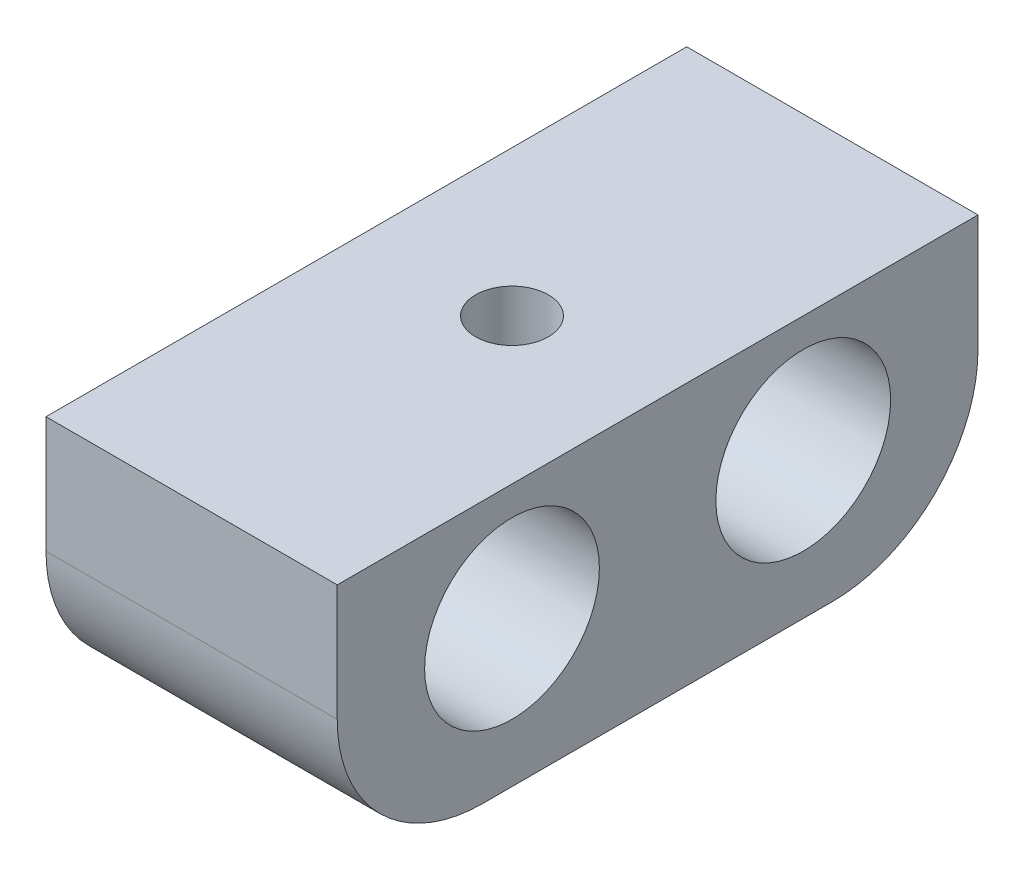
ISO-10303-21;
HEADER;
FILE_DESCRIPTION(('STEP AP214'),'2;1');
FILE_NAME('part.step','',(''),(''),'','','');
FILE_SCHEMA(('AUTOMOTIVE_DESIGN { 1 0 10303 214 1 1 1 1 }'));
ENDSEC;
DATA;
#1=APPLICATION_CONTEXT('core data for automotive mechanical design processes');
#2=APPLICATION_PROTOCOL_DEFINITION('international standard','automotive_design',2000,#1);
#3=PRODUCT_CONTEXT('',#1,'mechanical');
#4=PRODUCT('Part','Part','',(#3));
#5=PRODUCT_RELATED_PRODUCT_CATEGORY('part','',(#4));
#6=PRODUCT_DEFINITION_FORMATION('','',#4);
#7=PRODUCT_DEFINITION_CONTEXT('part definition',#1,'design');
#8=PRODUCT_DEFINITION('design','',#6,#7);
#9=PRODUCT_DEFINITION_SHAPE('','',#8);
#10=(LENGTH_UNIT() NAMED_UNIT(*) SI_UNIT(.MILLI.,.METRE.));
#11=(NAMED_UNIT(*) PLANE_ANGLE_UNIT() SI_UNIT($,.RADIAN.));
#12=(NAMED_UNIT(*) SI_UNIT($,.STERADIAN.) SOLID_ANGLE_UNIT());
#13=UNCERTAINTY_MEASURE_WITH_UNIT(LENGTH_MEASURE(1.E-05),#10,'distance_accuracy_value','');
#14=(GEOMETRIC_REPRESENTATION_CONTEXT(3) GLOBAL_UNCERTAINTY_ASSIGNED_CONTEXT((#13)) GLOBAL_UNIT_ASSIGNED_CONTEXT((#10,
#11,#12)) REPRESENTATION_CONTEXT('',''));
#15=CARTESIAN_POINT('',(0.,0.,0.));
#16=DIRECTION('',(0.,0.,1.));
#17=DIRECTION('',(1.,0.,0.));
#18=AXIS2_PLACEMENT_3D('',#15,#16,#17);
#19=CARTESIAN_POINT('',(10.,0.,0.));
#20=DIRECTION('',(1.,0.,0.));
#21=DIRECTION('',(0.,0.,-1.));
#22=AXIS2_PLACEMENT_3D('',#19,#20,#21);
#23=PLANE('',#22);
#24=CARTESIAN_POINT('',(10.,0.,0.));
#25=DIRECTION('',(1.,0.,0.));
#26=DIRECTION('',(0.,0.,-1.));
#27=AXIS2_PLACEMENT_3D('',#24,#25,#26);
#28=CIRCLE('',#27,3.);
#29=CARTESIAN_POINT('',(10.,0.,-3.));
#30=VERTEX_POINT('',#29);
#31=EDGE_CURVE('E115',#30,#30,#28,.T.);
#32=ORIENTED_EDGE('',*,*,#31,.F.);
#33=EDGE_LOOP('',(#32));
#34=FACE_BOUND('',#33,.T.);
#35=DIRECTION('',(0.,0.,-1.));
#36=VECTOR('',#35,1.);
#37=CARTESIAN_POINT('',(10.,-5.,6.));
#38=LINE('',#37,#36);
#39=CARTESIAN_POINT('',(10.,-5.,1.));
#40=VERTEX_POINT('',#39);
#41=CARTESIAN_POINT('',(10.,-5.,-11.));
#42=VERTEX_POINT('',#41);
#43=EDGE_CURVE('E127',#40,#42,#38,.T.);
#44=ORIENTED_EDGE('',*,*,#43,.T.);
#45=CARTESIAN_POINT('',(10.,0.,-11.));
#46=DIRECTION('',(1.,0.,0.));
#47=DIRECTION('',(0.,0.,-1.));
#48=AXIS2_PLACEMENT_3D('',#45,#46,#47);
#49=CIRCLE('',#48,5.);
#50=CARTESIAN_POINT('',(10.,0.,-16.));
#51=VERTEX_POINT('',#50);
#52=EDGE_CURVE('E47',#42,#51,#49,.T.);
#53=ORIENTED_EDGE('',*,*,#52,.T.);
#54=DIRECTION('',(0.,1.,0.));
#55=VECTOR('',#54,1.);
#56=CARTESIAN_POINT('',(10.,-5.,-16.));
#57=LINE('',#56,#55);
#58=CARTESIAN_POINT('',(10.,4.,-16.));
#59=VERTEX_POINT('',#58);
#60=EDGE_CURVE('E129',#51,#59,#57,.T.);
#61=ORIENTED_EDGE('',*,*,#60,.T.);
#62=DIRECTION('',(0.,0.,1.));
#63=VECTOR('',#62,1.);
#64=CARTESIAN_POINT('',(10.,4.,-16.));
#65=LINE('',#64,#63);
#66=CARTESIAN_POINT('',(10.,4.,6.));
#67=VERTEX_POINT('',#66);
#68=EDGE_CURVE('E121',#59,#67,#65,.T.);
#69=ORIENTED_EDGE('',*,*,#68,.T.);
#70=DIRECTION('',(0.,-1.,0.));
#71=VECTOR('',#70,1.);
#72=CARTESIAN_POINT('',(10.,4.,6.));
#73=LINE('',#72,#71);
#74=CARTESIAN_POINT('',(10.,0.,6.));
#75=VERTEX_POINT('',#74);
#76=EDGE_CURVE('E124',#67,#75,#73,.T.);
#77=ORIENTED_EDGE('',*,*,#76,.T.);
#78=CARTESIAN_POINT('',(10.,0.,1.));
#79=DIRECTION('',(1.,0.,0.));
#80=DIRECTION('',(0.,0.,-1.));
#81=AXIS2_PLACEMENT_3D('',#78,#79,#80);
#82=CIRCLE('',#81,5.);
#83=EDGE_CURVE('E155',#75,#40,#82,.T.);
#84=ORIENTED_EDGE('',*,*,#83,.T.);
#85=EDGE_LOOP('',(#44,#53,#61,#69,#77,#84));
#86=FACE_BOUND('',#85,.T.);
#87=CARTESIAN_POINT('',(10.,0.,-10.));
#88=DIRECTION('',(1.,0.,0.));
#89=DIRECTION('',(0.,0.,-1.));
#90=AXIS2_PLACEMENT_3D('',#87,#88,#89);
#91=CIRCLE('',#90,3.);
#92=CARTESIAN_POINT('',(10.,0.,-13.));
#93=VERTEX_POINT('',#92);
#94=EDGE_CURVE('E107',#93,#93,#91,.T.);
#95=ORIENTED_EDGE('',*,*,#94,.F.);
#96=EDGE_LOOP('',(#95));
#97=FACE_BOUND('',#96,.T.);
#98=ADVANCED_FACE('F39',(#34,#86,#97),#23,.T.);
#99=CARTESIAN_POINT('',(0.,0.,0.));
#100=DIRECTION('',(1.,0.,0.));
#101=DIRECTION('',(0.,0.,-1.));
#102=AXIS2_PLACEMENT_3D('',#99,#100,#101);
#103=PLANE('',#102);
#104=CARTESIAN_POINT('',(0.,0.,0.));
#105=DIRECTION('',(1.,0.,0.));
#106=DIRECTION('',(0.,0.,-1.));
#107=AXIS2_PLACEMENT_3D('',#104,#105,#106);
#108=CIRCLE('',#107,3.);
#109=CARTESIAN_POINT('',(0.,0.,-3.));
#110=VERTEX_POINT('',#109);
#111=EDGE_CURVE('E113',#110,#110,#108,.T.);
#112=ORIENTED_EDGE('',*,*,#111,.T.);
#113=EDGE_LOOP('',(#112));
#114=FACE_BOUND('',#113,.T.);
#115=DIRECTION('',(0.,1.,0.));
#116=VECTOR('',#115,1.);
#117=CARTESIAN_POINT('',(0.,-5.,-16.));
#118=LINE('',#117,#116);
#119=CARTESIAN_POINT('',(0.,0.,-16.));
#120=VERTEX_POINT('',#119);
#121=CARTESIAN_POINT('',(0.,4.,-16.));
#122=VERTEX_POINT('',#121);
#123=EDGE_CURVE('E125',#120,#122,#118,.T.);
#124=ORIENTED_EDGE('',*,*,#123,.F.);
#125=CARTESIAN_POINT('',(0.,0.,-11.));
#126=DIRECTION('',(1.,0.,0.));
#127=DIRECTION('',(0.,0.,-1.));
#128=AXIS2_PLACEMENT_3D('',#125,#126,#127);
#129=CIRCLE('',#128,5.);
#130=CARTESIAN_POINT('',(0.,-5.,-11.));
#131=VERTEX_POINT('',#130);
#132=EDGE_CURVE('E149',#120,#131,#129,.F.);
#133=ORIENTED_EDGE('',*,*,#132,.T.);
#134=DIRECTION('',(0.,0.,-1.));
#135=VECTOR('',#134,1.);
#136=CARTESIAN_POINT('',(0.,-5.,6.));
#137=LINE('',#136,#135);
#138=CARTESIAN_POINT('',(0.,-5.,1.));
#139=VERTEX_POINT('',#138);
#140=EDGE_CURVE('E136',#139,#131,#137,.T.);
#141=ORIENTED_EDGE('',*,*,#140,.F.);
#142=CARTESIAN_POINT('',(0.,0.,1.));
#143=DIRECTION('',(1.,0.,0.));
#144=DIRECTION('',(0.,0.,-1.));
#145=AXIS2_PLACEMENT_3D('',#142,#143,#144);
#146=CIRCLE('',#145,5.);
#147=CARTESIAN_POINT('',(0.,0.,6.));
#148=VERTEX_POINT('',#147);
#149=EDGE_CURVE('E147',#139,#148,#146,.F.);
#150=ORIENTED_EDGE('',*,*,#149,.T.);
#151=DIRECTION('',(0.,-1.,0.));
#152=VECTOR('',#151,1.);
#153=CARTESIAN_POINT('',(0.,4.,6.));
#154=LINE('',#153,#152);
#155=CARTESIAN_POINT('',(0.,4.,6.));
#156=VERTEX_POINT('',#155);
#157=EDGE_CURVE('E134',#156,#148,#154,.T.);
#158=ORIENTED_EDGE('',*,*,#157,.F.);
#159=DIRECTION('',(0.,0.,1.));
#160=VECTOR('',#159,1.);
#161=CARTESIAN_POINT('',(0.,4.,-16.));
#162=LINE('',#161,#160);
#163=EDGE_CURVE('E118',#122,#156,#162,.T.);
#164=ORIENTED_EDGE('',*,*,#163,.F.);
#165=EDGE_LOOP('',(#124,#133,#141,#150,#158,#164));
#166=FACE_BOUND('',#165,.T.);
#167=CARTESIAN_POINT('',(0.,0.,-10.));
#168=DIRECTION('',(1.,0.,0.));
#169=DIRECTION('',(0.,0.,-1.));
#170=AXIS2_PLACEMENT_3D('',#167,#168,#169);
#171=CIRCLE('',#170,3.);
#172=CARTESIAN_POINT('',(0.,0.,-13.));
#173=VERTEX_POINT('',#172);
#174=EDGE_CURVE('E103',#173,#173,#171,.T.);
#175=ORIENTED_EDGE('',*,*,#174,.T.);
#176=EDGE_LOOP('',(#175));
#177=FACE_BOUND('',#176,.T.);
#178=ADVANCED_FACE('F170',(#114,#166,#177),#103,.F.);
#179=CARTESIAN_POINT('',(10.,4.,-16.));
#180=DIRECTION('',(0.,-1.,0.));
#181=DIRECTION('',(0.,0.,-1.));
#182=AXIS2_PLACEMENT_3D('',#179,#180,#181);
#183=PLANE('',#182);
#184=CARTESIAN_POINT('',(5.,4.,-5.));
#185=DIRECTION('',(0.,1.,0.));
#186=DIRECTION('',(0.,0.,1.));
#187=AXIS2_PLACEMENT_3D('',#184,#185,#186);
#188=CIRCLE('',#187,1.24999999999999);
#189=CARTESIAN_POINT('',(5.,4.,-3.75000000000001));
#190=VERTEX_POINT('',#189);
#191=EDGE_CURVE('E104',#190,#190,#188,.T.);
#192=ORIENTED_EDGE('',*,*,#191,.F.);
#193=EDGE_LOOP('',(#192));
#194=FACE_BOUND('',#193,.T.);
#195=ORIENTED_EDGE('',*,*,#163,.T.);
#196=DIRECTION('',(-1.,0.,0.));
#197=VECTOR('',#196,1.);
#198=CARTESIAN_POINT('',(10.,4.,6.));
#199=LINE('',#198,#197);
#200=EDGE_CURVE('E141',#67,#156,#199,.T.);
#201=ORIENTED_EDGE('',*,*,#200,.F.);
#202=ORIENTED_EDGE('',*,*,#68,.F.);
#203=DIRECTION('',(-1.,0.,0.));
#204=VECTOR('',#203,1.);
#205=CARTESIAN_POINT('',(10.,4.,-16.));
#206=LINE('',#205,#204);
#207=EDGE_CURVE('E131',#59,#122,#206,.T.);
#208=ORIENTED_EDGE('',*,*,#207,.T.);
#209=EDGE_LOOP('',(#195,#201,#202,#208));
#210=FACE_BOUND('',#209,.T.);
#211=ADVANCED_FACE('F180',(#194,#210),#183,.F.);
#212=CARTESIAN_POINT('',(10.,4.,6.));
#213=DIRECTION('',(0.,0.,-1.));
#214=DIRECTION('',(0.,1.,0.));
#215=AXIS2_PLACEMENT_3D('',#212,#213,#214);
#216=PLANE('',#215);
#217=ORIENTED_EDGE('',*,*,#157,.T.);
#218=DIRECTION('',(-1.,0.,0.));
#219=VECTOR('',#218,1.);
#220=CARTESIAN_POINT('',(10.,0.,6.));
#221=LINE('',#220,#219);
#222=EDGE_CURVE('E11',#148,#75,#221,.F.);
#223=ORIENTED_EDGE('',*,*,#222,.T.);
#224=ORIENTED_EDGE('',*,*,#76,.F.);
#225=ORIENTED_EDGE('',*,*,#200,.T.);
#226=EDGE_LOOP('',(#217,#223,#224,#225));
#227=FACE_BOUND('',#226,.T.);
#228=ADVANCED_FACE('F177',(#227),#216,.F.);
#229=CARTESIAN_POINT('',(10.,-5.,6.));
#230=DIRECTION('',(0.,1.,0.));
#231=DIRECTION('',(0.,0.,1.));
#232=AXIS2_PLACEMENT_3D('',#229,#230,#231);
#233=PLANE('',#232);
#234=ORIENTED_EDGE('',*,*,#140,.T.);
#235=DIRECTION('',(-1.,0.,0.));
#236=VECTOR('',#235,1.);
#237=CARTESIAN_POINT('',(10.,-5.,-11.));
#238=LINE('',#237,#236);
#239=EDGE_CURVE('E60',#131,#42,#238,.F.);
#240=ORIENTED_EDGE('',*,*,#239,.T.);
#241=ORIENTED_EDGE('',*,*,#43,.F.);
#242=DIRECTION('',(-1.,0.,0.));
#243=VECTOR('',#242,1.);
#244=CARTESIAN_POINT('',(10.,-5.,1.));
#245=LINE('',#244,#243);
#246=EDGE_CURVE('E151',#40,#139,#245,.T.);
#247=ORIENTED_EDGE('',*,*,#246,.T.);
#248=EDGE_LOOP('',(#234,#240,#241,#247));
#249=FACE_BOUND('',#248,.T.);
#250=ADVANCED_FACE('F173',(#249),#233,.F.);
#251=CARTESIAN_POINT('',(10.,-5.,-16.));
#252=DIRECTION('',(0.,0.,1.));
#253=DIRECTION('',(1.,0.,0.));
#254=AXIS2_PLACEMENT_3D('',#251,#252,#253);
#255=PLANE('',#254);
#256=ORIENTED_EDGE('',*,*,#60,.F.);
#257=DIRECTION('',(-1.,0.,0.));
#258=VECTOR('',#257,1.);
#259=CARTESIAN_POINT('',(10.,0.,-16.));
#260=LINE('',#259,#258);
#261=EDGE_CURVE('E144',#51,#120,#260,.T.);
#262=ORIENTED_EDGE('',*,*,#261,.T.);
#263=ORIENTED_EDGE('',*,*,#123,.T.);
#264=ORIENTED_EDGE('',*,*,#207,.F.);
#265=EDGE_LOOP('',(#256,#262,#263,#264));
#266=FACE_BOUND('',#265,.T.);
#267=ADVANCED_FACE('F164',(#266),#255,.F.);
#268=CARTESIAN_POINT('',(10.,0.,0.));
#269=DIRECTION('',(-1.,0.,0.));
#270=DIRECTION('',(0.,0.,1.));
#271=AXIS2_PLACEMENT_3D('',#268,#269,#270);
#272=CYLINDRICAL_SURFACE('',#271,3.);
#273=ORIENTED_EDGE('',*,*,#31,.T.);
#274=EDGE_LOOP('',(#273));
#275=FACE_BOUND('',#274,.T.);
#276=ORIENTED_EDGE('',*,*,#111,.F.);
#277=EDGE_LOOP('',(#276));
#278=FACE_BOUND('',#277,.T.);
#279=ADVANCED_FACE('F199',(#275,#278),#272,.F.);
#280=CARTESIAN_POINT('',(10.,0.,-10.));
#281=DIRECTION('',(-1.,0.,0.));
#282=DIRECTION('',(0.,0.,1.));
#283=AXIS2_PLACEMENT_3D('',#280,#281,#282);
#284=CYLINDRICAL_SURFACE('',#283,3.);
#285=ORIENTED_EDGE('',*,*,#94,.T.);
#286=EDGE_LOOP('',(#285));
#287=FACE_BOUND('',#286,.T.);
#288=ORIENTED_EDGE('',*,*,#174,.F.);
#289=EDGE_LOOP('',(#288));
#290=FACE_BOUND('',#289,.T.);
#291=ADVANCED_FACE('F220',(#287,#290),#284,.F.);
#292=CARTESIAN_POINT('',(10.,0.,-11.));
#293=DIRECTION('',(-1.,0.,0.));
#294=DIRECTION('',(0.,0.,1.));
#295=AXIS2_PLACEMENT_3D('',#292,#293,#294);
#296=CYLINDRICAL_SURFACE('',#295,5.);
#297=ORIENTED_EDGE('',*,*,#52,.F.);
#298=ORIENTED_EDGE('',*,*,#239,.F.);
#299=ORIENTED_EDGE('',*,*,#132,.F.);
#300=ORIENTED_EDGE('',*,*,#261,.F.);
#301=EDGE_LOOP('',(#297,#298,#299,#300));
#302=FACE_BOUND('',#301,.T.);
#303=ADVANCED_FACE('F167',(#302),#296,.T.);
#304=CARTESIAN_POINT('',(10.,0.,1.));
#305=DIRECTION('',(-1.,0.,0.));
#306=DIRECTION('',(0.,0.,1.));
#307=AXIS2_PLACEMENT_3D('',#304,#305,#306);
#308=CYLINDRICAL_SURFACE('',#307,5.);
#309=ORIENTED_EDGE('',*,*,#83,.F.);
#310=ORIENTED_EDGE('',*,*,#222,.F.);
#311=ORIENTED_EDGE('',*,*,#149,.F.);
#312=ORIENTED_EDGE('',*,*,#246,.F.);
#313=EDGE_LOOP('',(#309,#310,#311,#312));
#314=FACE_BOUND('',#313,.T.);
#315=ADVANCED_FACE('F41',(#314),#308,.T.);
#316=CARTESIAN_POINT('',(5.,-3.49999999999999,-5.));
#317=DIRECTION('',(0.,1.,0.));
#318=DIRECTION('',(0.,0.,1.));
#319=AXIS2_PLACEMENT_3D('',#316,#317,#318);
#320=CONICAL_SURFACE('',#319,1.24999999999999,1.02974425867664);
#321=CARTESIAN_POINT('',(5.,-4.25107577378445,-5.));
#322=VERTEX_POINT('',#321);
#323=VERTEX_LOOP('',#322);
#324=FACE_BOUND('',#323,.T.);
#325=CARTESIAN_POINT('',(5.,-3.49999999999999,-5.));
#326=DIRECTION('',(0.,1.,0.));
#327=DIRECTION('',(0.,0.,1.));
#328=AXIS2_PLACEMENT_3D('',#325,#326,#327);
#329=CIRCLE('',#328,1.24999999999999);
#330=CARTESIAN_POINT('',(5.,-3.49999999999999,-3.75000000000001));
#331=VERTEX_POINT('',#330);
#332=EDGE_CURVE('E101',#331,#331,#329,.T.);
#333=ORIENTED_EDGE('',*,*,#332,.T.);
#334=EDGE_LOOP('',(#333));
#335=FACE_BOUND('',#334,.T.);
#336=ADVANCED_FACE('F94',(#324,#335),#320,.F.);
#337=CARTESIAN_POINT('',(5.,4.,-5.));
#338=DIRECTION('',(0.,1.,0.));
#339=DIRECTION('',(0.,0.,1.));
#340=AXIS2_PLACEMENT_3D('',#337,#338,#339);
#341=CYLINDRICAL_SURFACE('',#340,1.24999999999999);
#342=ORIENTED_EDGE('',*,*,#332,.F.);
#343=EDGE_LOOP('',(#342));
#344=FACE_BOUND('',#343,.T.);
#345=ORIENTED_EDGE('',*,*,#191,.T.);
#346=EDGE_LOOP('',(#345));
#347=FACE_BOUND('',#346,.T.);
#348=ADVANCED_FACE('F97',(#344,#347),#341,.F.);
#349=CLOSED_SHELL('',(#98,#178,#211,#228,#250,#267,#279,#291,#303,#315,#336,#348));
#350=MANIFOLD_SOLID_BREP('B2',#349);
#351=ADVANCED_BREP_SHAPE_REPRESENTATION('',(#18,#350),#14);
#352=SHAPE_DEFINITION_REPRESENTATION(#9,#351);
ENDSEC;
END-ISO-10303-21;
